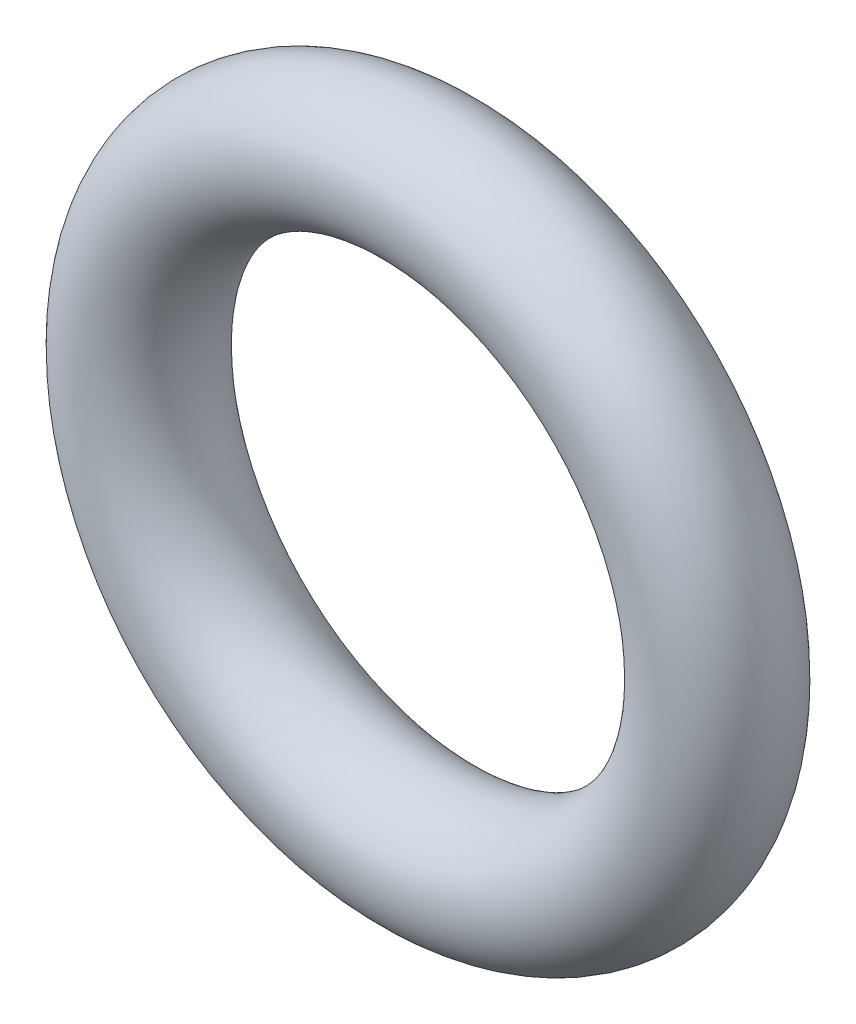
ISO-10303-21;
HEADER;
FILE_DESCRIPTION(('STEP AP214'),'2;1');
FILE_NAME('part.step','',(''),(''),'','','');
FILE_SCHEMA(('AUTOMOTIVE_DESIGN { 1 0 10303 214 1 1 1 1 }'));
ENDSEC;
DATA;
#1=APPLICATION_CONTEXT('core data for automotive mechanical design processes');
#2=APPLICATION_PROTOCOL_DEFINITION('international standard','automotive_design',2000,#1);
#3=PRODUCT_CONTEXT('',#1,'mechanical');
#4=PRODUCT('Part','Part','',(#3));
#5=PRODUCT_RELATED_PRODUCT_CATEGORY('part','',(#4));
#6=PRODUCT_DEFINITION_FORMATION('','',#4);
#7=PRODUCT_DEFINITION_CONTEXT('part definition',#1,'design');
#8=PRODUCT_DEFINITION('design','',#6,#7);
#9=PRODUCT_DEFINITION_SHAPE('','',#8);
#10=(LENGTH_UNIT() NAMED_UNIT(*) SI_UNIT(.MILLI.,.METRE.));
#11=(NAMED_UNIT(*) PLANE_ANGLE_UNIT() SI_UNIT($,.RADIAN.));
#12=(NAMED_UNIT(*) SI_UNIT($,.STERADIAN.) SOLID_ANGLE_UNIT());
#13=UNCERTAINTY_MEASURE_WITH_UNIT(LENGTH_MEASURE(1.E-05),#10,'distance_accuracy_value','');
#14=(GEOMETRIC_REPRESENTATION_CONTEXT(3) GLOBAL_UNCERTAINTY_ASSIGNED_CONTEXT((#13)) GLOBAL_UNIT_ASSIGNED_CONTEXT((#10,
#11,#12)) REPRESENTATION_CONTEXT('',''));
#15=CARTESIAN_POINT('',(0.,0.,0.));
#16=DIRECTION('',(0.,0.,1.));
#17=DIRECTION('',(1.,0.,0.));
#18=AXIS2_PLACEMENT_3D('',#15,#16,#17);
#19=CARTESIAN_POINT('',(0.,0.,0.));
#20=DIRECTION('',(0.,0.,1.));
#21=DIRECTION('',(1.,0.,0.));
#22=AXIS2_PLACEMENT_3D('',#19,#20,#21);
#23=TOROIDAL_SURFACE('',#22,3.9243,0.888999999999998);
#24=CARTESIAN_POINT('',(4.8133,0.,0.));
#25=VERTEX_POINT('',#24);
#26=VERTEX_LOOP('',#25);
#27=FACE_BOUND('',#26,.T.);
#28=ADVANCED_FACE('F28',(#27),#23,.T.);
#29=CLOSED_SHELL('',(#28));
#30=MANIFOLD_SOLID_BREP('B2',#29);
#31=ADVANCED_BREP_SHAPE_REPRESENTATION('',(#18,#30),#14);
#32=SHAPE_DEFINITION_REPRESENTATION(#9,#31);
ENDSEC;
END-ISO-10303-21;
